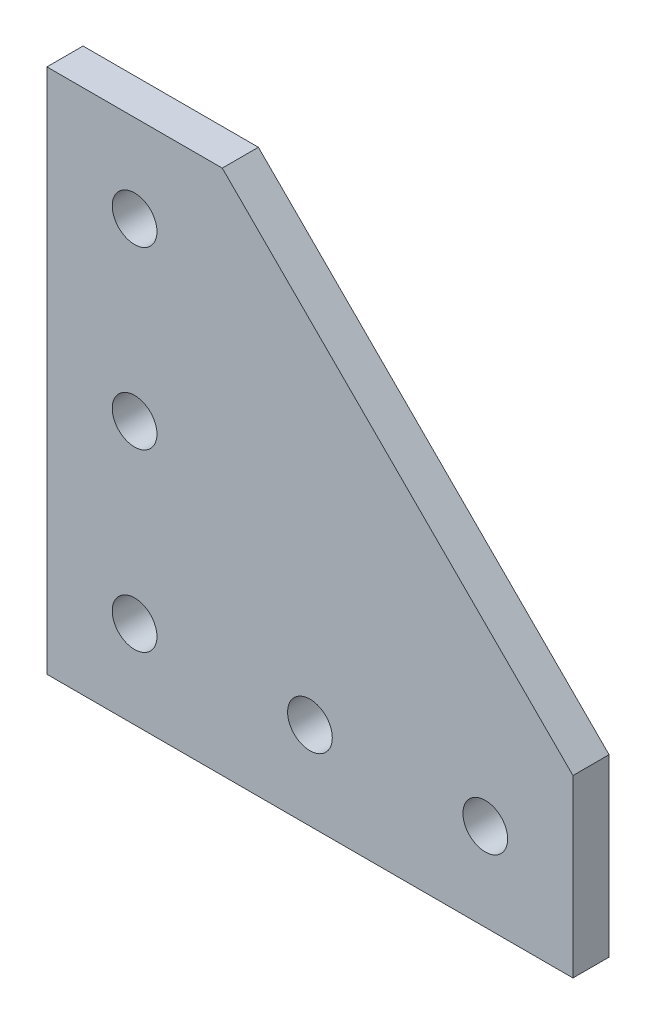
ISO-10303-21;
HEADER;
FILE_DESCRIPTION(('STEP AP214'),'2;1');
FILE_NAME('part.step','',(''),(''),'','','');
FILE_SCHEMA(('AUTOMOTIVE_DESIGN { 1 0 10303 214 1 1 1 1 }'));
ENDSEC;
DATA;
#1=APPLICATION_CONTEXT('core data for automotive mechanical design processes');
#2=APPLICATION_PROTOCOL_DEFINITION('international standard','automotive_design',2000,#1);
#3=PRODUCT_CONTEXT('',#1,'mechanical');
#4=PRODUCT('Part','Part','',(#3));
#5=PRODUCT_RELATED_PRODUCT_CATEGORY('part','',(#4));
#6=PRODUCT_DEFINITION_FORMATION('','',#4);
#7=PRODUCT_DEFINITION_CONTEXT('part definition',#1,'design');
#8=PRODUCT_DEFINITION('design','',#6,#7);
#9=PRODUCT_DEFINITION_SHAPE('','',#8);
#10=(LENGTH_UNIT() NAMED_UNIT(*) SI_UNIT(.MILLI.,.METRE.));
#11=(NAMED_UNIT(*) PLANE_ANGLE_UNIT() SI_UNIT($,.RADIAN.));
#12=(NAMED_UNIT(*) SI_UNIT($,.STERADIAN.) SOLID_ANGLE_UNIT());
#13=UNCERTAINTY_MEASURE_WITH_UNIT(LENGTH_MEASURE(1.E-05),#10,'distance_accuracy_value','');
#14=(GEOMETRIC_REPRESENTATION_CONTEXT(3) GLOBAL_UNCERTAINTY_ASSIGNED_CONTEXT((#13)) GLOBAL_UNIT_ASSIGNED_CONTEXT((#10,
#11,#12)) REPRESENTATION_CONTEXT('',''));
#15=CARTESIAN_POINT('',(0.,0.,0.));
#16=DIRECTION('',(0.,0.,1.));
#17=DIRECTION('',(1.,0.,0.));
#18=AXIS2_PLACEMENT_3D('',#15,#16,#17);
#19=CARTESIAN_POINT('',(0.,0.,4.12));
#20=DIRECTION('',(0.,1.,0.));
#21=DIRECTION('',(0.,0.,1.));
#22=AXIS2_PLACEMENT_3D('',#19,#20,#21);
#23=PLANE('',#22);
#24=DIRECTION('',(1.,0.,0.));
#25=VECTOR('',#24,1.);
#26=CARTESIAN_POINT('',(0.,0.,0.));
#27=LINE('',#26,#25);
#28=CARTESIAN_POINT('',(0.,0.,0.));
#29=VERTEX_POINT('',#28);
#30=CARTESIAN_POINT('',(60.,0.,0.));
#31=VERTEX_POINT('',#30);
#32=EDGE_CURVE('E124',#29,#31,#27,.T.);
#33=ORIENTED_EDGE('',*,*,#32,.T.);
#34=DIRECTION('',(0.,0.,-1.));
#35=VECTOR('',#34,1.);
#36=CARTESIAN_POINT('',(60.,0.,4.12));
#37=LINE('',#36,#35);
#38=CARTESIAN_POINT('',(60.,0.,4.12));
#39=VERTEX_POINT('',#38);
#40=EDGE_CURVE('E11',#39,#31,#37,.T.);
#41=ORIENTED_EDGE('',*,*,#40,.F.);
#42=DIRECTION('',(1.,0.,0.));
#43=VECTOR('',#42,1.);
#44=CARTESIAN_POINT('',(0.,0.,4.12));
#45=LINE('',#44,#43);
#46=CARTESIAN_POINT('',(0.,0.,4.12));
#47=VERTEX_POINT('',#46);
#48=EDGE_CURVE('E138',#47,#39,#45,.T.);
#49=ORIENTED_EDGE('',*,*,#48,.F.);
#50=DIRECTION('',(0.,0.,-1.));
#51=VECTOR('',#50,1.);
#52=CARTESIAN_POINT('',(0.,0.,4.12));
#53=LINE('',#52,#51);
#54=EDGE_CURVE('E120',#47,#29,#53,.T.);
#55=ORIENTED_EDGE('',*,*,#54,.T.);
#56=EDGE_LOOP('',(#33,#41,#49,#55));
#57=FACE_BOUND('',#56,.T.);
#58=ADVANCED_FACE('F45',(#57),#23,.F.);
#59=CARTESIAN_POINT('',(60.,0.,4.12));
#60=DIRECTION('',(-1.,0.,0.));
#61=DIRECTION('',(0.,0.,1.));
#62=AXIS2_PLACEMENT_3D('',#59,#60,#61);
#63=PLANE('',#62);
#64=DIRECTION('',(0.,1.,0.));
#65=VECTOR('',#64,1.);
#66=CARTESIAN_POINT('',(60.,0.,0.));
#67=LINE('',#66,#65);
#68=CARTESIAN_POINT('',(60.,20.,0.));
#69=VERTEX_POINT('',#68);
#70=EDGE_CURVE('E128',#31,#69,#67,.T.);
#71=ORIENTED_EDGE('',*,*,#70,.T.);
#72=DIRECTION('',(0.,0.,-1.));
#73=VECTOR('',#72,1.);
#74=CARTESIAN_POINT('',(60.,20.,4.12));
#75=LINE('',#74,#73);
#76=CARTESIAN_POINT('',(60.,20.,4.12));
#77=VERTEX_POINT('',#76);
#78=EDGE_CURVE('E54',#77,#69,#75,.T.);
#79=ORIENTED_EDGE('',*,*,#78,.F.);
#80=DIRECTION('',(0.,1.,0.));
#81=VECTOR('',#80,1.);
#82=CARTESIAN_POINT('',(60.,0.,4.12));
#83=LINE('',#82,#81);
#84=EDGE_CURVE('E96',#39,#77,#83,.T.);
#85=ORIENTED_EDGE('',*,*,#84,.F.);
#86=ORIENTED_EDGE('',*,*,#40,.T.);
#87=EDGE_LOOP('',(#71,#79,#85,#86));
#88=FACE_BOUND('',#87,.T.);
#89=ADVANCED_FACE('F161',(#88),#63,.F.);
#90=CARTESIAN_POINT('',(20.,60.,4.12));
#91=DIRECTION('',(-0.707106781186548,-0.707106781186548,0.));
#92=DIRECTION('',(0.707106781186548,-0.707106781186548,0.));
#93=AXIS2_PLACEMENT_3D('',#90,#91,#92);
#94=PLANE('',#93);
#95=DIRECTION('',(-0.707106781186548,0.707106781186548,0.));
#96=VECTOR('',#95,1.);
#97=CARTESIAN_POINT('',(20.,60.,0.));
#98=LINE('',#97,#96);
#99=CARTESIAN_POINT('',(20.,60.,0.));
#100=VERTEX_POINT('',#99);
#101=EDGE_CURVE('E112',#69,#100,#98,.T.);
#102=ORIENTED_EDGE('',*,*,#101,.T.);
#103=DIRECTION('',(0.,0.,-1.));
#104=VECTOR('',#103,1.);
#105=CARTESIAN_POINT('',(20.,60.,4.12));
#106=LINE('',#105,#104);
#107=CARTESIAN_POINT('',(20.,60.,4.12));
#108=VERTEX_POINT('',#107);
#109=EDGE_CURVE('E109',#108,#100,#106,.T.);
#110=ORIENTED_EDGE('',*,*,#109,.F.);
#111=DIRECTION('',(-0.707106781186548,0.707106781186548,0.));
#112=VECTOR('',#111,1.);
#113=CARTESIAN_POINT('',(20.,60.,4.12));
#114=LINE('',#113,#112);
#115=EDGE_CURVE('E100',#77,#108,#114,.T.);
#116=ORIENTED_EDGE('',*,*,#115,.F.);
#117=ORIENTED_EDGE('',*,*,#78,.T.);
#118=EDGE_LOOP('',(#102,#110,#116,#117));
#119=FACE_BOUND('',#118,.T.);
#120=ADVANCED_FACE('F110',(#119),#94,.F.);
#121=CARTESIAN_POINT('',(0.,60.,4.12));
#122=DIRECTION('',(0.,-1.,0.));
#123=DIRECTION('',(0.,0.,-1.));
#124=AXIS2_PLACEMENT_3D('',#121,#122,#123);
#125=PLANE('',#124);
#126=DIRECTION('',(-1.,0.,0.));
#127=VECTOR('',#126,1.);
#128=CARTESIAN_POINT('',(0.,60.,0.));
#129=LINE('',#128,#127);
#130=CARTESIAN_POINT('',(0.,60.,0.));
#131=VERTEX_POINT('',#130);
#132=EDGE_CURVE('E82',#100,#131,#129,.T.);
#133=ORIENTED_EDGE('',*,*,#132,.T.);
#134=DIRECTION('',(0.,0.,-1.));
#135=VECTOR('',#134,1.);
#136=CARTESIAN_POINT('',(0.,60.,4.12));
#137=LINE('',#136,#135);
#138=CARTESIAN_POINT('',(0.,60.,4.12));
#139=VERTEX_POINT('',#138);
#140=EDGE_CURVE('E114',#139,#131,#137,.T.);
#141=ORIENTED_EDGE('',*,*,#140,.F.);
#142=DIRECTION('',(-1.,0.,0.));
#143=VECTOR('',#142,1.);
#144=CARTESIAN_POINT('',(0.,60.,4.12));
#145=LINE('',#144,#143);
#146=EDGE_CURVE('E104',#108,#139,#145,.T.);
#147=ORIENTED_EDGE('',*,*,#146,.F.);
#148=ORIENTED_EDGE('',*,*,#109,.T.);
#149=EDGE_LOOP('',(#133,#141,#147,#148));
#150=FACE_BOUND('',#149,.T.);
#151=ADVANCED_FACE('F116',(#150),#125,.F.);
#152=CARTESIAN_POINT('',(0.,0.,4.12));
#153=DIRECTION('',(1.,0.,0.));
#154=DIRECTION('',(0.,0.,-1.));
#155=AXIS2_PLACEMENT_3D('',#152,#153,#154);
#156=PLANE('',#155);
#157=DIRECTION('',(0.,-1.,0.));
#158=VECTOR('',#157,1.);
#159=CARTESIAN_POINT('',(0.,0.,0.));
#160=LINE('',#159,#158);
#161=EDGE_CURVE('E88',#131,#29,#160,.T.);
#162=ORIENTED_EDGE('',*,*,#161,.T.);
#163=ORIENTED_EDGE('',*,*,#54,.F.);
#164=DIRECTION('',(0.,-1.,0.));
#165=VECTOR('',#164,1.);
#166=CARTESIAN_POINT('',(0.,0.,4.12));
#167=LINE('',#166,#165);
#168=EDGE_CURVE('E62',#139,#47,#167,.T.);
#169=ORIENTED_EDGE('',*,*,#168,.F.);
#170=ORIENTED_EDGE('',*,*,#140,.T.);
#171=EDGE_LOOP('',(#162,#163,#169,#170));
#172=FACE_BOUND('',#171,.T.);
#173=ADVANCED_FACE('F149',(#172),#156,.F.);
#174=CARTESIAN_POINT('',(0.,0.,4.12));
#175=DIRECTION('',(0.,0.,1.));
#176=DIRECTION('',(1.,0.,0.));
#177=AXIS2_PLACEMENT_3D('',#174,#175,#176);
#178=PLANE('',#177);
#179=CARTESIAN_POINT('',(10.,50.,4.12));
#180=DIRECTION('',(0.,0.,1.));
#181=DIRECTION('',(1.,0.,0.));
#182=AXIS2_PLACEMENT_3D('',#179,#180,#181);
#183=CIRCLE('',#182,2.55);
#184=CARTESIAN_POINT('',(12.55,50.,4.12));
#185=VERTEX_POINT('',#184);
#186=EDGE_CURVE('E254',#185,#185,#183,.T.);
#187=ORIENTED_EDGE('',*,*,#186,.F.);
#188=EDGE_LOOP('',(#187));
#189=FACE_BOUND('',#188,.T.);
#190=CARTESIAN_POINT('',(10.,30.,4.12));
#191=DIRECTION('',(0.,0.,1.));
#192=DIRECTION('',(1.,0.,0.));
#193=AXIS2_PLACEMENT_3D('',#190,#191,#192);
#194=CIRCLE('',#193,2.55);
#195=CARTESIAN_POINT('',(12.55,30.,4.12));
#196=VERTEX_POINT('',#195);
#197=EDGE_CURVE('E261',#196,#196,#194,.T.);
#198=ORIENTED_EDGE('',*,*,#197,.F.);
#199=EDGE_LOOP('',(#198));
#200=FACE_BOUND('',#199,.T.);
#201=CARTESIAN_POINT('',(50.,10.,4.12));
#202=DIRECTION('',(0.,0.,1.));
#203=DIRECTION('',(1.,0.,0.));
#204=AXIS2_PLACEMENT_3D('',#201,#202,#203);
#205=CIRCLE('',#204,2.55);
#206=CARTESIAN_POINT('',(52.55,10.,4.12));
#207=VERTEX_POINT('',#206);
#208=EDGE_CURVE('E283',#207,#207,#205,.T.);
#209=ORIENTED_EDGE('',*,*,#208,.F.);
#210=EDGE_LOOP('',(#209));
#211=FACE_BOUND('',#210,.T.);
#212=CARTESIAN_POINT('',(30.,10.,4.12));
#213=DIRECTION('',(0.,0.,1.));
#214=DIRECTION('',(1.,0.,0.));
#215=AXIS2_PLACEMENT_3D('',#212,#213,#214);
#216=CIRCLE('',#215,2.55000000000001);
#217=CARTESIAN_POINT('',(32.55,10.,4.12));
#218=VERTEX_POINT('',#217);
#219=EDGE_CURVE('E273',#218,#218,#216,.T.);
#220=ORIENTED_EDGE('',*,*,#219,.F.);
#221=EDGE_LOOP('',(#220));
#222=FACE_BOUND('',#221,.T.);
#223=CARTESIAN_POINT('',(10.,10.,4.12));
#224=DIRECTION('',(0.,0.,1.));
#225=DIRECTION('',(1.,0.,0.));
#226=AXIS2_PLACEMENT_3D('',#223,#224,#225);
#227=CIRCLE('',#226,2.55);
#228=CARTESIAN_POINT('',(12.55,10.,4.12));
#229=VERTEX_POINT('',#228);
#230=EDGE_CURVE('E269',#229,#229,#227,.T.);
#231=ORIENTED_EDGE('',*,*,#230,.F.);
#232=EDGE_LOOP('',(#231));
#233=FACE_BOUND('',#232,.T.);
#234=ORIENTED_EDGE('',*,*,#48,.T.);
#235=ORIENTED_EDGE('',*,*,#84,.T.);
#236=ORIENTED_EDGE('',*,*,#115,.T.);
#237=ORIENTED_EDGE('',*,*,#146,.T.);
#238=ORIENTED_EDGE('',*,*,#168,.T.);
#239=EDGE_LOOP('',(#234,#235,#236,#237,#238));
#240=FACE_BOUND('',#239,.T.);
#241=ADVANCED_FACE('F102',(#189,#200,#211,#222,#233,#240),#178,.T.);
#242=CARTESIAN_POINT('',(0.,0.,0.));
#243=DIRECTION('',(0.,0.,1.));
#244=DIRECTION('',(1.,0.,0.));
#245=AXIS2_PLACEMENT_3D('',#242,#243,#244);
#246=PLANE('',#245);
#247=CARTESIAN_POINT('',(10.,50.,0.));
#248=DIRECTION('',(0.,0.,1.));
#249=DIRECTION('',(1.,0.,0.));
#250=AXIS2_PLACEMENT_3D('',#247,#248,#249);
#251=CIRCLE('',#250,2.55);
#252=CARTESIAN_POINT('',(12.55,50.,0.));
#253=VERTEX_POINT('',#252);
#254=EDGE_CURVE('E251',#253,#253,#251,.T.);
#255=ORIENTED_EDGE('',*,*,#254,.T.);
#256=EDGE_LOOP('',(#255));
#257=FACE_BOUND('',#256,.T.);
#258=CARTESIAN_POINT('',(10.,30.,0.));
#259=DIRECTION('',(0.,0.,1.));
#260=DIRECTION('',(1.,0.,0.));
#261=AXIS2_PLACEMENT_3D('',#258,#259,#260);
#262=CIRCLE('',#261,2.55);
#263=CARTESIAN_POINT('',(12.55,30.,0.));
#264=VERTEX_POINT('',#263);
#265=EDGE_CURVE('E256',#264,#264,#262,.T.);
#266=ORIENTED_EDGE('',*,*,#265,.T.);
#267=EDGE_LOOP('',(#266));
#268=FACE_BOUND('',#267,.T.);
#269=CARTESIAN_POINT('',(50.,10.,0.));
#270=DIRECTION('',(0.,0.,1.));
#271=DIRECTION('',(1.,0.,0.));
#272=AXIS2_PLACEMENT_3D('',#269,#270,#271);
#273=CIRCLE('',#272,2.55);
#274=CARTESIAN_POINT('',(52.55,10.,0.));
#275=VERTEX_POINT('',#274);
#276=EDGE_CURVE('E287',#275,#275,#273,.T.);
#277=ORIENTED_EDGE('',*,*,#276,.T.);
#278=EDGE_LOOP('',(#277));
#279=FACE_BOUND('',#278,.T.);
#280=CARTESIAN_POINT('',(30.,10.,0.));
#281=DIRECTION('',(0.,0.,1.));
#282=DIRECTION('',(1.,0.,0.));
#283=AXIS2_PLACEMENT_3D('',#280,#281,#282);
#284=CIRCLE('',#283,2.55000000000001);
#285=CARTESIAN_POINT('',(32.55,10.,0.));
#286=VERTEX_POINT('',#285);
#287=EDGE_CURVE('E279',#286,#286,#284,.T.);
#288=ORIENTED_EDGE('',*,*,#287,.T.);
#289=EDGE_LOOP('',(#288));
#290=FACE_BOUND('',#289,.T.);
#291=CARTESIAN_POINT('',(10.,10.,0.));
#292=DIRECTION('',(0.,0.,1.));
#293=DIRECTION('',(1.,0.,0.));
#294=AXIS2_PLACEMENT_3D('',#291,#292,#293);
#295=CIRCLE('',#294,2.55);
#296=CARTESIAN_POINT('',(12.55,10.,0.));
#297=VERTEX_POINT('',#296);
#298=EDGE_CURVE('E129',#297,#297,#295,.T.);
#299=ORIENTED_EDGE('',*,*,#298,.T.);
#300=EDGE_LOOP('',(#299));
#301=FACE_BOUND('',#300,.T.);
#302=ORIENTED_EDGE('',*,*,#32,.F.);
#303=ORIENTED_EDGE('',*,*,#161,.F.);
#304=ORIENTED_EDGE('',*,*,#132,.F.);
#305=ORIENTED_EDGE('',*,*,#101,.F.);
#306=ORIENTED_EDGE('',*,*,#70,.F.);
#307=EDGE_LOOP('',(#302,#303,#304,#305,#306));
#308=FACE_BOUND('',#307,.T.);
#309=ADVANCED_FACE('F145',(#257,#268,#279,#290,#301,#308),#246,.F.);
#310=CARTESIAN_POINT('',(10.,10.,0.));
#311=DIRECTION('',(0.,0.,1.));
#312=DIRECTION('',(1.,0.,0.));
#313=AXIS2_PLACEMENT_3D('',#310,#311,#312);
#314=CYLINDRICAL_SURFACE('',#313,2.55);
#315=ORIENTED_EDGE('',*,*,#298,.F.);
#316=EDGE_LOOP('',(#315));
#317=FACE_BOUND('',#316,.T.);
#318=ORIENTED_EDGE('',*,*,#230,.T.);
#319=EDGE_LOOP('',(#318));
#320=FACE_BOUND('',#319,.T.);
#321=ADVANCED_FACE('F196',(#317,#320),#314,.F.);
#322=CARTESIAN_POINT('',(30.,10.,0.));
#323=DIRECTION('',(0.,0.,1.));
#324=DIRECTION('',(1.,0.,0.));
#325=AXIS2_PLACEMENT_3D('',#322,#323,#324);
#326=CYLINDRICAL_SURFACE('',#325,2.55000000000001);
#327=ORIENTED_EDGE('',*,*,#287,.F.);
#328=EDGE_LOOP('',(#327));
#329=FACE_BOUND('',#328,.T.);
#330=ORIENTED_EDGE('',*,*,#219,.T.);
#331=EDGE_LOOP('',(#330));
#332=FACE_BOUND('',#331,.T.);
#333=ADVANCED_FACE('F205',(#329,#332),#326,.F.);
#334=CARTESIAN_POINT('',(50.,10.,0.));
#335=DIRECTION('',(0.,0.,1.));
#336=DIRECTION('',(1.,0.,0.));
#337=AXIS2_PLACEMENT_3D('',#334,#335,#336);
#338=CYLINDRICAL_SURFACE('',#337,2.55);
#339=ORIENTED_EDGE('',*,*,#276,.F.);
#340=EDGE_LOOP('',(#339));
#341=FACE_BOUND('',#340,.T.);
#342=ORIENTED_EDGE('',*,*,#208,.T.);
#343=EDGE_LOOP('',(#342));
#344=FACE_BOUND('',#343,.T.);
#345=ADVANCED_FACE('F215',(#341,#344),#338,.F.);
#346=CARTESIAN_POINT('',(10.,30.,0.));
#347=DIRECTION('',(0.,0.,1.));
#348=DIRECTION('',(1.,0.,0.));
#349=AXIS2_PLACEMENT_3D('',#346,#347,#348);
#350=CYLINDRICAL_SURFACE('',#349,2.55);
#351=ORIENTED_EDGE('',*,*,#265,.F.);
#352=EDGE_LOOP('',(#351));
#353=FACE_BOUND('',#352,.T.);
#354=ORIENTED_EDGE('',*,*,#197,.T.);
#355=EDGE_LOOP('',(#354));
#356=FACE_BOUND('',#355,.T.);
#357=ADVANCED_FACE('F225',(#353,#356),#350,.F.);
#358=CARTESIAN_POINT('',(10.,50.,0.));
#359=DIRECTION('',(0.,0.,1.));
#360=DIRECTION('',(1.,0.,0.));
#361=AXIS2_PLACEMENT_3D('',#358,#359,#360);
#362=CYLINDRICAL_SURFACE('',#361,2.55);
#363=ORIENTED_EDGE('',*,*,#254,.F.);
#364=EDGE_LOOP('',(#363));
#365=FACE_BOUND('',#364,.T.);
#366=ORIENTED_EDGE('',*,*,#186,.T.);
#367=EDGE_LOOP('',(#366));
#368=FACE_BOUND('',#367,.T.);
#369=ADVANCED_FACE('F235',(#365,#368),#362,.F.);
#370=CLOSED_SHELL('',(#58,#89,#120,#151,#173,#241,#309,#321,#333,#345,#357,#369));
#371=MANIFOLD_SOLID_BREP('B2',#370);
#372=ADVANCED_BREP_SHAPE_REPRESENTATION('',(#18,#371),#14);
#373=SHAPE_DEFINITION_REPRESENTATION(#9,#372);
ENDSEC;
END-ISO-10303-21;
